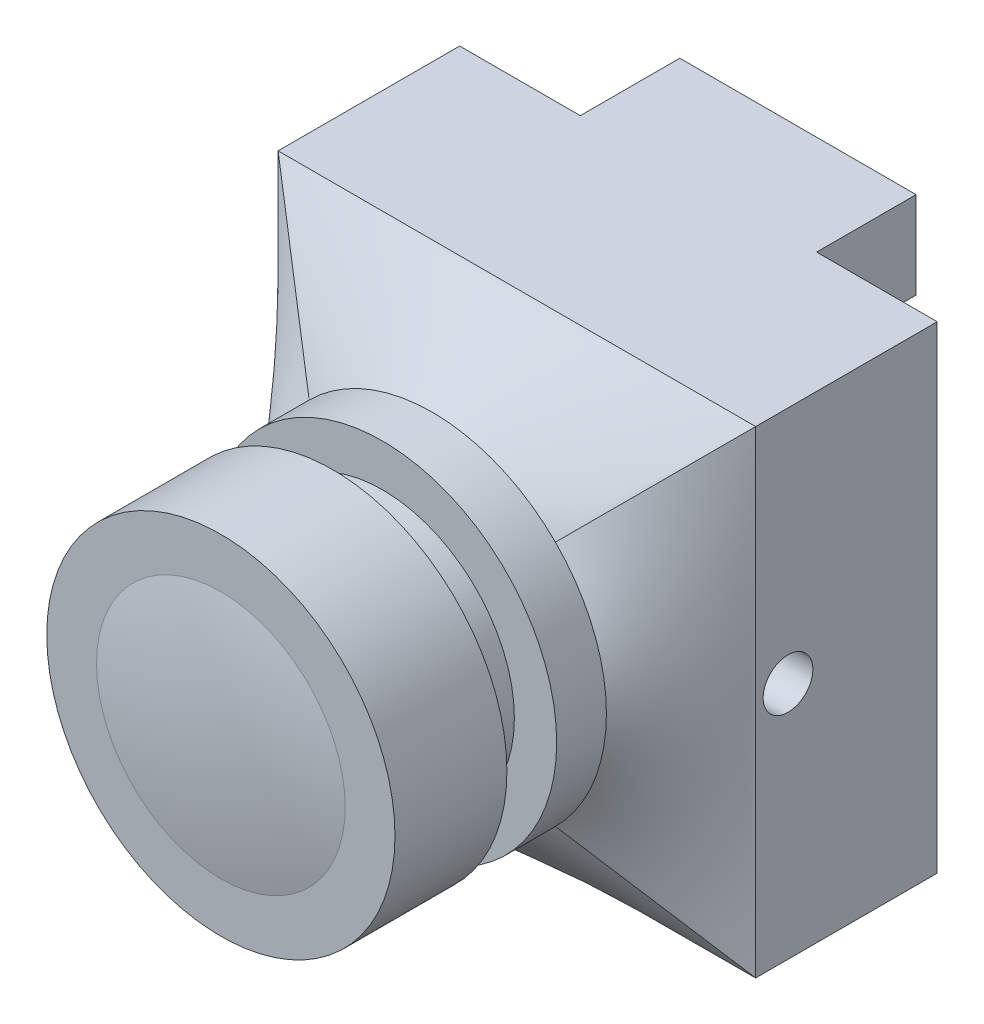
ISO-10303-21;
HEADER;
FILE_DESCRIPTION(('STEP AP214'),'2;1');
FILE_NAME('part.step','',(''),(''),'','','');
FILE_SCHEMA(('AUTOMOTIVE_DESIGN { 1 0 10303 214 1 1 1 1 }'));
ENDSEC;
DATA;
#1=APPLICATION_CONTEXT('core data for automotive mechanical design processes');
#2=APPLICATION_PROTOCOL_DEFINITION('international standard','automotive_design',2000,#1);
#3=PRODUCT_CONTEXT('',#1,'mechanical');
#4=PRODUCT('Part','Part','',(#3));
#5=PRODUCT_RELATED_PRODUCT_CATEGORY('part','',(#4));
#6=PRODUCT_DEFINITION_FORMATION('','',#4);
#7=PRODUCT_DEFINITION_CONTEXT('part definition',#1,'design');
#8=PRODUCT_DEFINITION('design','',#6,#7);
#9=PRODUCT_DEFINITION_SHAPE('','',#8);
#10=(LENGTH_UNIT() NAMED_UNIT(*) SI_UNIT(.MILLI.,.METRE.));
#11=(NAMED_UNIT(*) PLANE_ANGLE_UNIT() SI_UNIT($,.RADIAN.));
#12=(NAMED_UNIT(*) SI_UNIT($,.STERADIAN.) SOLID_ANGLE_UNIT());
#13=UNCERTAINTY_MEASURE_WITH_UNIT(LENGTH_MEASURE(1.E-05),#10,'distance_accuracy_value','');
#14=(GEOMETRIC_REPRESENTATION_CONTEXT(3) GLOBAL_UNCERTAINTY_ASSIGNED_CONTEXT((#13)) GLOBAL_UNIT_ASSIGNED_CONTEXT((#10,
#11,#12)) REPRESENTATION_CONTEXT('',''));
#15=CARTESIAN_POINT('',(0.,0.,0.));
#16=DIRECTION('',(0.,0.,1.));
#17=DIRECTION('',(1.,0.,0.));
#18=AXIS2_PLACEMENT_3D('',#15,#16,#17);
#19=CARTESIAN_POINT('',(0.,0.,0.));
#20=DIRECTION('',(0.,0.,1.));
#21=DIRECTION('',(1.,0.,0.));
#22=AXIS2_PLACEMENT_3D('',#19,#20,#21);
#23=PLANE('',#22);
#24=DIRECTION('',(0.,-1.,0.));
#25=VECTOR('',#24,1.);
#26=CARTESIAN_POINT('',(4.75,9.6,0.));
#27=LINE('',#26,#25);
#28=CARTESIAN_POINT('',(4.75,9.6,0.));
#29=VERTEX_POINT('',#28);
#30=CARTESIAN_POINT('',(4.75,6.1,0.));
#31=VERTEX_POINT('',#30);
#32=EDGE_CURVE('E180',#29,#31,#27,.T.);
#33=ORIENTED_EDGE('',*,*,#32,.F.);
#34=DIRECTION('',(-1.,0.,0.));
#35=VECTOR('',#34,1.);
#36=CARTESIAN_POINT('',(-9.6,9.6,0.));
#37=LINE('',#36,#35);
#38=CARTESIAN_POINT('',(9.6,9.6,0.));
#39=VERTEX_POINT('',#38);
#40=EDGE_CURVE('E384',#39,#29,#37,.T.);
#41=ORIENTED_EDGE('',*,*,#40,.F.);
#42=DIRECTION('',(0.,1.,0.));
#43=VECTOR('',#42,1.);
#44=CARTESIAN_POINT('',(9.6,9.6,0.));
#45=LINE('',#44,#43);
#46=CARTESIAN_POINT('',(9.6,-9.6,0.));
#47=VERTEX_POINT('',#46);
#48=EDGE_CURVE('E336',#47,#39,#45,.T.);
#49=ORIENTED_EDGE('',*,*,#48,.F.);
#50=DIRECTION('',(1.,0.,0.));
#51=VECTOR('',#50,1.);
#52=CARTESIAN_POINT('',(-9.6,-9.6,0.));
#53=LINE('',#52,#51);
#54=CARTESIAN_POINT('',(-9.6,-9.6,0.));
#55=VERTEX_POINT('',#54);
#56=EDGE_CURVE('E355',#55,#47,#53,.T.);
#57=ORIENTED_EDGE('',*,*,#56,.F.);
#58=DIRECTION('',(0.,-1.,0.));
#59=VECTOR('',#58,1.);
#60=CARTESIAN_POINT('',(-9.6,9.6,0.));
#61=LINE('',#60,#59);
#62=CARTESIAN_POINT('',(-9.6,9.6,0.));
#63=VERTEX_POINT('',#62);
#64=EDGE_CURVE('E360',#63,#55,#61,.T.);
#65=ORIENTED_EDGE('',*,*,#64,.F.);
#66=CARTESIAN_POINT('',(-4.75,9.6,0.));
#67=VERTEX_POINT('',#66);
#68=EDGE_CURVE('E98',#67,#63,#37,.T.);
#69=ORIENTED_EDGE('',*,*,#68,.F.);
#70=DIRECTION('',(0.,1.,0.));
#71=VECTOR('',#70,1.);
#72=CARTESIAN_POINT('',(-4.75,9.6,0.));
#73=LINE('',#72,#71);
#74=CARTESIAN_POINT('',(-4.75,6.1,0.));
#75=VERTEX_POINT('',#74);
#76=EDGE_CURVE('E177',#75,#67,#73,.T.);
#77=ORIENTED_EDGE('',*,*,#76,.F.);
#78=DIRECTION('',(-1.,0.,0.));
#79=VECTOR('',#78,1.);
#80=CARTESIAN_POINT('',(4.75,6.1,0.));
#81=LINE('',#80,#79);
#82=EDGE_CURVE('E92',#31,#75,#81,.T.);
#83=ORIENTED_EDGE('',*,*,#82,.F.);
#84=EDGE_LOOP('',(#33,#41,#49,#57,#65,#69,#77,#83));
#85=FACE_BOUND('',#84,.T.);
#86=ADVANCED_FACE('F73',(#85),#23,.F.);
#87=CARTESIAN_POINT('',(9.6,9.6,7.3));
#88=DIRECTION('',(-1.,0.,0.));
#89=DIRECTION('',(0.,0.,1.));
#90=AXIS2_PLACEMENT_3D('',#87,#88,#89);
#91=PLANE('',#90);
#92=CARTESIAN_POINT('',(9.6,0.,6.));
#93=DIRECTION('',(1.,0.,0.));
#94=DIRECTION('',(0.,0.,-1.));
#95=AXIS2_PLACEMENT_3D('',#92,#93,#94);
#96=CIRCLE('',#95,1.);
#97=CARTESIAN_POINT('',(9.6,0.,5.));
#98=VERTEX_POINT('',#97);
#99=EDGE_CURVE('E182',#98,#98,#96,.T.);
#100=ORIENTED_EDGE('',*,*,#99,.F.);
#101=EDGE_LOOP('',(#100));
#102=FACE_BOUND('',#101,.T.);
#103=ORIENTED_EDGE('',*,*,#48,.T.);
#104=DIRECTION('',(0.,0.,-1.));
#105=VECTOR('',#104,1.);
#106=CARTESIAN_POINT('',(9.6,9.6,7.3));
#107=LINE('',#106,#105);
#108=CARTESIAN_POINT('',(9.6,9.6,7.3));
#109=VERTEX_POINT('',#108);
#110=EDGE_CURVE('E84',#109,#39,#107,.T.);
#111=ORIENTED_EDGE('',*,*,#110,.F.);
#112=DIRECTION('',(0.,1.,0.));
#113=VECTOR('',#112,1.);
#114=CARTESIAN_POINT('',(9.6,9.6,7.3));
#115=LINE('',#114,#113);
#116=CARTESIAN_POINT('',(9.6,-9.6,7.3));
#117=VERTEX_POINT('',#116);
#118=EDGE_CURVE('E349',#117,#109,#115,.T.);
#119=ORIENTED_EDGE('',*,*,#118,.F.);
#120=DIRECTION('',(0.,0.,-1.));
#121=VECTOR('',#120,1.);
#122=CARTESIAN_POINT('',(9.6,-9.6,7.3));
#123=LINE('',#122,#121);
#124=EDGE_CURVE('E366',#117,#47,#123,.T.);
#125=ORIENTED_EDGE('',*,*,#124,.T.);
#126=EDGE_LOOP('',(#103,#111,#119,#125));
#127=FACE_BOUND('',#126,.T.);
#128=ADVANCED_FACE('F75',(#102,#127),#91,.F.);
#129=CARTESIAN_POINT('',(-9.6,9.6,7.3));
#130=DIRECTION('',(0.,-1.,0.));
#131=DIRECTION('',(0.,0.,-1.));
#132=AXIS2_PLACEMENT_3D('',#129,#130,#131);
#133=PLANE('',#132);
#134=ORIENTED_EDGE('',*,*,#40,.T.);
#135=DIRECTION('',(0.,0.,1.));
#136=VECTOR('',#135,1.);
#137=CARTESIAN_POINT('',(4.75,9.6,-4.));
#138=LINE('',#137,#136);
#139=CARTESIAN_POINT('',(4.75,9.6,-4.));
#140=VERTEX_POINT('',#139);
#141=EDGE_CURVE('E462',#140,#29,#138,.T.);
#142=ORIENTED_EDGE('',*,*,#141,.F.);
#143=DIRECTION('',(1.,0.,0.));
#144=VECTOR('',#143,1.);
#145=CARTESIAN_POINT('',(4.75,9.6,-4.));
#146=LINE('',#145,#144);
#147=CARTESIAN_POINT('',(-4.75,9.6,-4.));
#148=VERTEX_POINT('',#147);
#149=EDGE_CURVE('E172',#148,#140,#146,.T.);
#150=ORIENTED_EDGE('',*,*,#149,.F.);
#151=DIRECTION('',(0.,0.,1.));
#152=VECTOR('',#151,1.);
#153=CARTESIAN_POINT('',(-4.75,9.6,-4.));
#154=LINE('',#153,#152);
#155=EDGE_CURVE('E189',#148,#67,#154,.T.);
#156=ORIENTED_EDGE('',*,*,#155,.T.);
#157=ORIENTED_EDGE('',*,*,#68,.T.);
#158=DIRECTION('',(0.,0.,-1.));
#159=VECTOR('',#158,1.);
#160=CARTESIAN_POINT('',(-9.6,9.6,7.3));
#161=LINE('',#160,#159);
#162=CARTESIAN_POINT('',(-9.6,9.6,7.3));
#163=VERTEX_POINT('',#162);
#164=EDGE_CURVE('E373',#163,#63,#161,.T.);
#165=ORIENTED_EDGE('',*,*,#164,.F.);
#166=DIRECTION('',(1.,0.,0.));
#167=VECTOR('',#166,1.);
#168=CARTESIAN_POINT('',(-9.6,9.6,7.3));
#169=LINE('',#168,#167);
#170=EDGE_CURVE('E331',#109,#163,#169,.F.);
#171=ORIENTED_EDGE('',*,*,#170,.F.);
#172=ORIENTED_EDGE('',*,*,#110,.T.);
#173=EDGE_LOOP('',(#134,#142,#150,#156,#157,#165,#171,#172));
#174=FACE_BOUND('',#173,.T.);
#175=ADVANCED_FACE('F456',(#174),#133,.F.);
#176=CARTESIAN_POINT('',(-9.6,9.6,7.3));
#177=DIRECTION('',(1.,0.,0.));
#178=DIRECTION('',(0.,0.,-1.));
#179=AXIS2_PLACEMENT_3D('',#176,#177,#178);
#180=PLANE('',#179);
#181=CARTESIAN_POINT('',(-9.6,0.,6.));
#182=DIRECTION('',(1.,0.,0.));
#183=DIRECTION('',(0.,0.,-1.));
#184=AXIS2_PLACEMENT_3D('',#181,#182,#183);
#185=CIRCLE('',#184,1.);
#186=CARTESIAN_POINT('',(-9.6,0.,5.));
#187=VERTEX_POINT('',#186);
#188=EDGE_CURVE('E187',#187,#187,#185,.T.);
#189=ORIENTED_EDGE('',*,*,#188,.T.);
#190=EDGE_LOOP('',(#189));
#191=FACE_BOUND('',#190,.T.);
#192=ORIENTED_EDGE('',*,*,#64,.T.);
#193=DIRECTION('',(0.,0.,-1.));
#194=VECTOR('',#193,1.);
#195=CARTESIAN_POINT('',(-9.6,-9.6,7.3));
#196=LINE('',#195,#194);
#197=CARTESIAN_POINT('',(-9.6,-9.6,7.3));
#198=VERTEX_POINT('',#197);
#199=EDGE_CURVE('E369',#198,#55,#196,.T.);
#200=ORIENTED_EDGE('',*,*,#199,.F.);
#201=DIRECTION('',(0.,1.,0.));
#202=VECTOR('',#201,1.);
#203=CARTESIAN_POINT('',(-9.6,9.6,7.3));
#204=LINE('',#203,#202);
#205=EDGE_CURVE('E359',#163,#198,#204,.F.);
#206=ORIENTED_EDGE('',*,*,#205,.F.);
#207=ORIENTED_EDGE('',*,*,#164,.T.);
#208=EDGE_LOOP('',(#192,#200,#206,#207));
#209=FACE_BOUND('',#208,.T.);
#210=ADVANCED_FACE('F454',(#191,#209),#180,.F.);
#211=CARTESIAN_POINT('',(-9.6,-9.6,7.3));
#212=DIRECTION('',(0.,1.,0.));
#213=DIRECTION('',(0.,0.,1.));
#214=AXIS2_PLACEMENT_3D('',#211,#212,#213);
#215=PLANE('',#214);
#216=ORIENTED_EDGE('',*,*,#56,.T.);
#217=ORIENTED_EDGE('',*,*,#124,.F.);
#218=DIRECTION('',(1.,0.,0.));
#219=VECTOR('',#218,1.);
#220=CARTESIAN_POINT('',(-9.6,-9.6,7.3));
#221=LINE('',#220,#219);
#222=EDGE_CURVE('E363',#198,#117,#221,.T.);
#223=ORIENTED_EDGE('',*,*,#222,.F.);
#224=ORIENTED_EDGE('',*,*,#199,.T.);
#225=EDGE_LOOP('',(#216,#217,#223,#224));
#226=FACE_BOUND('',#225,.T.);
#227=ADVANCED_FACE('F450',(#226),#215,.F.);
#228=CARTESIAN_POINT('',(9.6,-9.6,7.3));
#229=CARTESIAN_POINT('',(4.94974746830583,-4.94974746830583,10.7));
#230=CARTESIAN_POINT('',(9.6,-8.8,7.3));
#231=CARTESIAN_POINT('',(5.2414141349725,-4.65808080163917,10.7));
#232=CARTESIAN_POINT('',(9.6,-8.,7.3));
#233=CARTESIAN_POINT('',(5.51805960745283,-4.32957833687793,10.7));
#234=CARTESIAN_POINT('',(9.6,-6.4,7.3));
#235=CARTESIAN_POINT('',(6.01750922433455,-3.60330586290059,10.7));
#236=CARTESIAN_POINT('',(9.6,-5.6,7.3));
#237=CARTESIAN_POINT('',(6.240151659734,-3.20549876475148,10.7));
#238=CARTESIAN_POINT('',(9.6,-3.99999999999999,7.3));
#239=CARTESIAN_POINT('',(6.6082346322556,-2.35498410023551,10.7));
#240=CARTESIAN_POINT('',(9.6,-3.19999999999999,7.3));
#241=CARTESIAN_POINT('',(6.75349475440457,-1.9023431213879,10.7));
#242=CARTESIAN_POINT('',(9.6,-1.59999999999999,7.3));
#243=CARTESIAN_POINT('',(6.9494382537719,-0.966389520987098,10.7));
#244=CARTESIAN_POINT('',(9.6,-0.799999999999995,7.3));
#245=CARTESIAN_POINT('',(7.,-0.483249156101945,10.7));
#246=CARTESIAN_POINT('',(9.6,0.800000000000005,7.3));
#247=CARTESIAN_POINT('',(7.,0.483249156101943,10.7));
#248=CARTESIAN_POINT('',(9.6,1.6,7.3));
#249=CARTESIAN_POINT('',(6.9494382537719,0.966389520987096,10.7));
#250=CARTESIAN_POINT('',(9.6,3.20000000000001,7.3));
#251=CARTESIAN_POINT('',(6.75349475440457,1.9023431213879,10.7));
#252=CARTESIAN_POINT('',(9.6,4.00000000000001,7.3));
#253=CARTESIAN_POINT('',(6.60823463225559,2.35498410023551,10.7));
#254=CARTESIAN_POINT('',(9.6,5.60000000000001,7.3));
#255=CARTESIAN_POINT('',(6.240151659734,3.20549876475148,10.7));
#256=CARTESIAN_POINT('',(9.6,6.4,7.3));
#257=CARTESIAN_POINT('',(6.01750922433455,3.60330586290059,10.7));
#258=CARTESIAN_POINT('',(9.6,8.,7.3));
#259=CARTESIAN_POINT('',(5.51805960745283,4.32957833687792,10.7));
#260=CARTESIAN_POINT('',(9.6,8.8,7.3));
#261=CARTESIAN_POINT('',(5.2414141349725,4.65808080163917,10.7));
#262=CARTESIAN_POINT('',(9.6,9.6,7.3));
#263=CARTESIAN_POINT('',(4.94974746830583,4.94974746830583,10.7));
#264=B_SPLINE_SURFACE_WITH_KNOTS('',3,1,((#228,#229),(#230,#231),(#232,#233),(#234,#235),(#236,
#237),(#238,#239),(#240,#241),(#242,#243),(#244,#245),(#246,#247),(#248,#249),(#250,#251),(#252,
#253),(#254,#255),(#256,#257),(#258,#259),(#260,#261),(#262,#263)),.UNSPECIFIED.,.F.,.F.,.F.,(4,
2,2,2,2,2,2,2,4),(2,2),(0.,0.125,0.25,0.375,0.5,0.625,0.75,0.875,1.),(0.,1.),.UNSPECIFIED.);
#265=DIRECTION('',(-0.628127541614492,-0.628127541614492,0.4592511109738));
#266=VECTOR('',#265,1.);
#267=CARTESIAN_POINT('',(7.27487373415292,7.27487373415292,9.));
#268=LINE('',#267,#266);
#269=CARTESIAN_POINT('',(4.94974746830583,4.94974746830583,10.7));
#270=VERTEX_POINT('',#269);
#271=EDGE_CURVE('E282',#109,#270,#268,.T.);
#272=CARTESIAN_POINT('',(0.,0.,10.7));
#273=DIRECTION('',(0.,0.,1.));
#274=DIRECTION('',(1.,0.,0.));
#275=AXIS2_PLACEMENT_3D('',#272,#273,#274);
#276=CIRCLE('',#275,7.);
#277=CARTESIAN_POINT('',(4.94974746830583,-4.94974746830583,10.7));
#278=VERTEX_POINT('',#277);
#279=EDGE_CURVE('E77',#278,#270,#276,.T.);
#280=DIRECTION('',(0.628127541614492,-0.628127541614492,-0.4592511109738));
#281=VECTOR('',#280,1.);
#282=CARTESIAN_POINT('',(7.27487373415291,-7.27487373415292,9.));
#283=LINE('',#282,#281);
#284=EDGE_CURVE('E278',#278,#117,#283,.T.);
#285=ORIENTED_EDGE('',*,*,#118,.T.);
#286=ORIENTED_EDGE('',*,*,#271,.T.);
#287=ORIENTED_EDGE('',*,*,#279,.F.);
#288=ORIENTED_EDGE('',*,*,#284,.T.);
#289=EDGE_LOOP('',(#285,#286,#287,#288));
#290=FACE_BOUND('',#289,.T.);
#291=ADVANCED_FACE('F239',(#290),#264,.T.);
#292=CARTESIAN_POINT('',(9.6,9.6,7.3));
#293=CARTESIAN_POINT('',(4.94974746830583,4.94974746830583,10.7));
#294=CARTESIAN_POINT('',(8.8,9.6,7.3));
#295=CARTESIAN_POINT('',(4.65808080163917,5.2414141349725,10.7));
#296=CARTESIAN_POINT('',(8.,9.6,7.3));
#297=CARTESIAN_POINT('',(4.32957833687792,5.51805960745283,10.7));
#298=CARTESIAN_POINT('',(6.4,9.6,7.3));
#299=CARTESIAN_POINT('',(3.60330586290059,6.01750922433454,10.7));
#300=CARTESIAN_POINT('',(5.6,9.6,7.3));
#301=CARTESIAN_POINT('',(3.20549876475148,6.240151659734,10.7));
#302=CARTESIAN_POINT('',(4.,9.6,7.3));
#303=CARTESIAN_POINT('',(2.35498410023551,6.6082346322556,10.7));
#304=CARTESIAN_POINT('',(3.2,9.6,7.3));
#305=CARTESIAN_POINT('',(1.9023431213879,6.75349475440457,10.7));
#306=CARTESIAN_POINT('',(1.6,9.6,7.3));
#307=CARTESIAN_POINT('',(0.966389520987097,6.9494382537719,10.7));
#308=CARTESIAN_POINT('',(0.799999999999996,9.6,7.3));
#309=CARTESIAN_POINT('',(0.483249156101945,7.,10.7));
#310=CARTESIAN_POINT('',(-0.800000000000004,9.6,7.3));
#311=CARTESIAN_POINT('',(-0.483249156101944,7.,10.7));
#312=CARTESIAN_POINT('',(-1.6,9.6,7.3));
#313=CARTESIAN_POINT('',(-0.966389520987097,6.9494382537719,10.7));
#314=CARTESIAN_POINT('',(-3.2,9.6,7.3));
#315=CARTESIAN_POINT('',(-1.9023431213879,6.75349475440457,10.7));
#316=CARTESIAN_POINT('',(-4.,9.6,7.3));
#317=CARTESIAN_POINT('',(-2.35498410023551,6.60823463225559,10.7));
#318=CARTESIAN_POINT('',(-5.6,9.6,7.3));
#319=CARTESIAN_POINT('',(-3.20549876475148,6.240151659734,10.7));
#320=CARTESIAN_POINT('',(-6.4,9.6,7.3));
#321=CARTESIAN_POINT('',(-3.60330586290059,6.01750922433455,10.7));
#322=CARTESIAN_POINT('',(-8.,9.6,7.3));
#323=CARTESIAN_POINT('',(-4.32957833687792,5.51805960745283,10.7));
#324=CARTESIAN_POINT('',(-8.8,9.6,7.3));
#325=CARTESIAN_POINT('',(-4.65808080163917,5.2414141349725,10.7));
#326=CARTESIAN_POINT('',(-9.6,9.6,7.3));
#327=CARTESIAN_POINT('',(-4.94974746830583,4.94974746830583,10.7));
#328=B_SPLINE_SURFACE_WITH_KNOTS('',3,1,((#292,#293),(#294,#295),(#296,#297),(#298,#299),(#300,
#301),(#302,#303),(#304,#305),(#306,#307),(#308,#309),(#310,#311),(#312,#313),(#314,#315),(#316,
#317),(#318,#319),(#320,#321),(#322,#323),(#324,#325),(#326,#327)),.UNSPECIFIED.,.F.,.F.,.F.,(4,
2,2,2,2,2,2,2,4),(2,2),(0.,0.125,0.25,0.375,0.5,0.625,0.75,0.875,1.),(0.,1.),.UNSPECIFIED.);
#329=DIRECTION('',(0.628127541614492,-0.628127541614492,0.4592511109738));
#330=VECTOR('',#329,1.);
#331=CARTESIAN_POINT('',(-7.27487373415292,7.27487373415292,9.));
#332=LINE('',#331,#330);
#333=CARTESIAN_POINT('',(-4.94974746830583,4.94974746830583,10.7));
#334=VERTEX_POINT('',#333);
#335=EDGE_CURVE('E321',#163,#334,#332,.T.);
#336=EDGE_CURVE('E276',#270,#334,#276,.T.);
#337=ORIENTED_EDGE('',*,*,#170,.T.);
#338=ORIENTED_EDGE('',*,*,#335,.T.);
#339=ORIENTED_EDGE('',*,*,#336,.F.);
#340=ORIENTED_EDGE('',*,*,#271,.F.);
#341=EDGE_LOOP('',(#337,#338,#339,#340));
#342=FACE_BOUND('',#341,.T.);
#343=ADVANCED_FACE('F327',(#342),#328,.T.);
#344=CARTESIAN_POINT('',(-9.6,-9.6,7.3));
#345=CARTESIAN_POINT('',(-4.94974746830583,-4.94974746830583,10.7));
#346=CARTESIAN_POINT('',(-8.8,-9.6,7.3));
#347=CARTESIAN_POINT('',(-4.65808080163917,-5.2414141349725,10.7));
#348=CARTESIAN_POINT('',(-8.,-9.6,7.3));
#349=CARTESIAN_POINT('',(-4.32957833687793,-5.51805960745283,10.7));
#350=CARTESIAN_POINT('',(-6.4,-9.6,7.3));
#351=CARTESIAN_POINT('',(-3.60330586290059,-6.01750922433455,10.7));
#352=CARTESIAN_POINT('',(-5.6,-9.6,7.3));
#353=CARTESIAN_POINT('',(-3.20549876475148,-6.240151659734,10.7));
#354=CARTESIAN_POINT('',(-3.99999999999999,-9.6,7.3));
#355=CARTESIAN_POINT('',(-2.35498410023551,-6.6082346322556,10.7));
#356=CARTESIAN_POINT('',(-3.19999999999999,-9.6,7.3));
#357=CARTESIAN_POINT('',(-1.9023431213879,-6.75349475440457,10.7));
#358=CARTESIAN_POINT('',(-1.59999999999999,-9.6,7.3));
#359=CARTESIAN_POINT('',(-0.966389520987099,-6.9494382537719,10.7));
#360=CARTESIAN_POINT('',(-0.799999999999995,-9.6,7.3));
#361=CARTESIAN_POINT('',(-0.483249156101946,-7.,10.7));
#362=CARTESIAN_POINT('',(0.800000000000005,-9.6,7.3));
#363=CARTESIAN_POINT('',(0.483249156101943,-7.,10.7));
#364=CARTESIAN_POINT('',(1.6,-9.6,7.3));
#365=CARTESIAN_POINT('',(0.966389520987096,-6.9494382537719,10.7));
#366=CARTESIAN_POINT('',(3.20000000000001,-9.6,7.3));
#367=CARTESIAN_POINT('',(1.9023431213879,-6.75349475440457,10.7));
#368=CARTESIAN_POINT('',(4.00000000000001,-9.6,7.3));
#369=CARTESIAN_POINT('',(2.35498410023551,-6.60823463225559,10.7));
#370=CARTESIAN_POINT('',(5.60000000000001,-9.6,7.3));
#371=CARTESIAN_POINT('',(3.20549876475148,-6.240151659734,10.7));
#372=CARTESIAN_POINT('',(6.4,-9.6,7.3));
#373=CARTESIAN_POINT('',(3.60330586290059,-6.01750922433455,10.7));
#374=CARTESIAN_POINT('',(8.,-9.6,7.3));
#375=CARTESIAN_POINT('',(4.32957833687792,-5.51805960745283,10.7));
#376=CARTESIAN_POINT('',(8.8,-9.6,7.3));
#377=CARTESIAN_POINT('',(4.65808080163916,-5.2414141349725,10.7));
#378=CARTESIAN_POINT('',(9.6,-9.6,7.3));
#379=CARTESIAN_POINT('',(4.94974746830583,-4.94974746830583,10.7));
#380=B_SPLINE_SURFACE_WITH_KNOTS('',3,1,((#344,#345),(#346,#347),(#348,#349),(#350,#351),(#352,
#353),(#354,#355),(#356,#357),(#358,#359),(#360,#361),(#362,#363),(#364,#365),(#366,#367),(#368,
#369),(#370,#371),(#372,#373),(#374,#375),(#376,#377),(#378,#379)),.UNSPECIFIED.,.F.,.F.,.F.,(4,
2,2,2,2,2,2,2,4),(2,2),(0.,0.125,0.25,0.375,0.5,0.625,0.75,0.875,1.),(0.,1.),.UNSPECIFIED.);
#381=CARTESIAN_POINT('',(-4.94974746830583,-4.94974746830583,10.7));
#382=VERTEX_POINT('',#381);
#383=EDGE_CURVE('E264',#382,#278,#276,.T.);
#384=DIRECTION('',(0.628127541614492,0.628127541614492,0.4592511109738));
#385=VECTOR('',#384,1.);
#386=CARTESIAN_POINT('',(-7.27487373415292,-7.27487373415292,9.));
#387=LINE('',#386,#385);
#388=EDGE_CURVE('E267',#198,#382,#387,.T.);
#389=ORIENTED_EDGE('',*,*,#222,.T.);
#390=ORIENTED_EDGE('',*,*,#284,.F.);
#391=ORIENTED_EDGE('',*,*,#383,.F.);
#392=ORIENTED_EDGE('',*,*,#388,.F.);
#393=EDGE_LOOP('',(#389,#390,#391,#392));
#394=FACE_BOUND('',#393,.T.);
#395=ADVANCED_FACE('F404',(#394),#380,.T.);
#396=CARTESIAN_POINT('',(-9.6,9.6,7.3));
#397=CARTESIAN_POINT('',(-4.94974746830583,4.94974746830583,10.7));
#398=CARTESIAN_POINT('',(-9.6,8.8,7.3));
#399=CARTESIAN_POINT('',(-5.2414141349725,4.65808080163917,10.7));
#400=CARTESIAN_POINT('',(-9.6,8.,7.3));
#401=CARTESIAN_POINT('',(-5.51805960745283,4.32957833687792,10.7));
#402=CARTESIAN_POINT('',(-9.6,6.4,7.3));
#403=CARTESIAN_POINT('',(-6.01750922433454,3.60330586290059,10.7));
#404=CARTESIAN_POINT('',(-9.6,5.6,7.3));
#405=CARTESIAN_POINT('',(-6.240151659734,3.20549876475148,10.7));
#406=CARTESIAN_POINT('',(-9.6,4.,7.3));
#407=CARTESIAN_POINT('',(-6.6082346322556,2.35498410023551,10.7));
#408=CARTESIAN_POINT('',(-9.6,3.2,7.3));
#409=CARTESIAN_POINT('',(-6.75349475440457,1.9023431213879,10.7));
#410=CARTESIAN_POINT('',(-9.6,1.6,7.3));
#411=CARTESIAN_POINT('',(-6.9494382537719,0.966389520987098,10.7));
#412=CARTESIAN_POINT('',(-9.6,0.799999999999996,7.3));
#413=CARTESIAN_POINT('',(-7.,0.483249156101945,10.7));
#414=CARTESIAN_POINT('',(-9.6,-0.800000000000004,7.3));
#415=CARTESIAN_POINT('',(-7.,-0.483249156101943,10.7));
#416=CARTESIAN_POINT('',(-9.6,-1.6,7.3));
#417=CARTESIAN_POINT('',(-6.9494382537719,-0.966389520987096,10.7));
#418=CARTESIAN_POINT('',(-9.6,-3.2,7.3));
#419=CARTESIAN_POINT('',(-6.75349475440457,-1.9023431213879,10.7));
#420=CARTESIAN_POINT('',(-9.6,-4.,7.3));
#421=CARTESIAN_POINT('',(-6.6082346322556,-2.35498410023551,10.7));
#422=CARTESIAN_POINT('',(-9.6,-5.6,7.3));
#423=CARTESIAN_POINT('',(-6.240151659734,-3.20549876475148,10.7));
#424=CARTESIAN_POINT('',(-9.6,-6.4,7.3));
#425=CARTESIAN_POINT('',(-6.01750922433455,-3.60330586290059,10.7));
#426=CARTESIAN_POINT('',(-9.6,-8.,7.3));
#427=CARTESIAN_POINT('',(-5.51805960745283,-4.32957833687793,10.7));
#428=CARTESIAN_POINT('',(-9.6,-8.8,7.3));
#429=CARTESIAN_POINT('',(-5.2414141349725,-4.65808080163917,10.7));
#430=CARTESIAN_POINT('',(-9.6,-9.6,7.3));
#431=CARTESIAN_POINT('',(-4.94974746830583,-4.94974746830583,10.7));
#432=B_SPLINE_SURFACE_WITH_KNOTS('',3,1,((#396,#397),(#398,#399),(#400,#401),(#402,#403),(#404,
#405),(#406,#407),(#408,#409),(#410,#411),(#412,#413),(#414,#415),(#416,#417),(#418,#419),(#420,
#421),(#422,#423),(#424,#425),(#426,#427),(#428,#429),(#430,#431)),.UNSPECIFIED.,.F.,.F.,.F.,(4,
2,2,2,2,2,2,2,4),(2,2),(0.,0.125,0.25,0.375,0.5,0.625,0.75,0.875,1.),(0.,1.),.UNSPECIFIED.);
#433=EDGE_CURVE('E272',#334,#382,#276,.T.);
#434=ORIENTED_EDGE('',*,*,#205,.T.);
#435=ORIENTED_EDGE('',*,*,#388,.T.);
#436=ORIENTED_EDGE('',*,*,#433,.F.);
#437=ORIENTED_EDGE('',*,*,#335,.F.);
#438=EDGE_LOOP('',(#434,#435,#436,#437));
#439=FACE_BOUND('',#438,.T.);
#440=ADVANCED_FACE('F237',(#439),#432,.T.);
#441=CARTESIAN_POINT('',(0.,0.,12.7));
#442=DIRECTION('',(0.,0.,-1.));
#443=DIRECTION('',(-1.,0.,0.));
#444=AXIS2_PLACEMENT_3D('',#441,#442,#443);
#445=CYLINDRICAL_SURFACE('',#444,7.);
#446=ORIENTED_EDGE('',*,*,#336,.T.);
#447=ORIENTED_EDGE('',*,*,#433,.T.);
#448=ORIENTED_EDGE('',*,*,#383,.T.);
#449=ORIENTED_EDGE('',*,*,#279,.T.);
#450=EDGE_LOOP('',(#446,#447,#448,#449));
#451=FACE_BOUND('',#450,.T.);
#452=CARTESIAN_POINT('',(0.,0.,12.7));
#453=DIRECTION('',(0.,0.,1.));
#454=DIRECTION('',(1.,0.,0.));
#455=AXIS2_PLACEMENT_3D('',#452,#453,#454);
#456=CIRCLE('',#455,7.);
#457=CARTESIAN_POINT('',(7.,0.,12.7));
#458=VERTEX_POINT('',#457);
#459=EDGE_CURVE('E286',#458,#458,#456,.T.);
#460=ORIENTED_EDGE('',*,*,#459,.F.);
#461=EDGE_LOOP('',(#460));
#462=FACE_BOUND('',#461,.T.);
#463=ADVANCED_FACE('F232',(#451,#462),#445,.T.);
#464=CARTESIAN_POINT('',(0.,0.,12.7));
#465=DIRECTION('',(0.,0.,1.));
#466=DIRECTION('',(1.,0.,0.));
#467=AXIS2_PLACEMENT_3D('',#464,#465,#466);
#468=PLANE('',#467);
#469=CARTESIAN_POINT('',(0.,0.,12.7));
#470=DIRECTION('',(0.,0.,1.));
#471=DIRECTION('',(1.,0.,0.));
#472=AXIS2_PLACEMENT_3D('',#469,#470,#471);
#473=CIRCLE('',#472,5.3);
#474=CARTESIAN_POINT('',(5.3,0.,12.7));
#475=VERTEX_POINT('',#474);
#476=EDGE_CURVE('E12',#475,#475,#473,.T.);
#477=ORIENTED_EDGE('',*,*,#476,.F.);
#478=EDGE_LOOP('',(#477));
#479=FACE_BOUND('',#478,.T.);
#480=ORIENTED_EDGE('',*,*,#459,.T.);
#481=EDGE_LOOP('',(#480));
#482=FACE_BOUND('',#481,.T.);
#483=ADVANCED_FACE('F228',(#479,#482),#468,.T.);
#484=CARTESIAN_POINT('',(0.,0.,14.7));
#485=DIRECTION('',(0.,0.,-1.));
#486=DIRECTION('',(-1.,0.,0.));
#487=AXIS2_PLACEMENT_3D('',#484,#485,#486);
#488=CYLINDRICAL_SURFACE('',#487,5.3);
#489=CARTESIAN_POINT('',(0.,0.,14.7));
#490=DIRECTION('',(0.,0.,1.));
#491=DIRECTION('',(1.,0.,0.));
#492=AXIS2_PLACEMENT_3D('',#489,#490,#491);
#493=CIRCLE('',#492,5.3);
#494=CARTESIAN_POINT('',(5.3,0.,14.7));
#495=VERTEX_POINT('',#494);
#496=EDGE_CURVE('E289',#495,#495,#493,.T.);
#497=ORIENTED_EDGE('',*,*,#496,.F.);
#498=EDGE_LOOP('',(#497));
#499=FACE_BOUND('',#498,.T.);
#500=ORIENTED_EDGE('',*,*,#476,.T.);
#501=EDGE_LOOP('',(#500));
#502=FACE_BOUND('',#501,.T.);
#503=ADVANCED_FACE('F224',(#499,#502),#488,.T.);
#504=CARTESIAN_POINT('',(0.,0.,19.2));
#505=DIRECTION('',(0.,0.,-1.));
#506=DIRECTION('',(-1.,0.,0.));
#507=AXIS2_PLACEMENT_3D('',#504,#505,#506);
#508=CYLINDRICAL_SURFACE('',#507,7.);
#509=CARTESIAN_POINT('',(0.,0.,19.2));
#510=DIRECTION('',(0.,0.,1.));
#511=DIRECTION('',(1.,0.,0.));
#512=AXIS2_PLACEMENT_3D('',#509,#510,#511);
#513=CIRCLE('',#512,7.);
#514=CARTESIAN_POINT('',(7.,0.,19.2));
#515=VERTEX_POINT('',#514);
#516=EDGE_CURVE('E294',#515,#515,#513,.T.);
#517=ORIENTED_EDGE('',*,*,#516,.F.);
#518=EDGE_LOOP('',(#517));
#519=FACE_BOUND('',#518,.T.);
#520=CARTESIAN_POINT('',(0.,0.,14.7));
#521=DIRECTION('',(0.,0.,1.));
#522=DIRECTION('',(1.,0.,0.));
#523=AXIS2_PLACEMENT_3D('',#520,#521,#522);
#524=CIRCLE('',#523,7.);
#525=CARTESIAN_POINT('',(7.,0.,14.7));
#526=VERTEX_POINT('',#525);
#527=EDGE_CURVE('E297',#526,#526,#524,.T.);
#528=ORIENTED_EDGE('',*,*,#527,.T.);
#529=EDGE_LOOP('',(#528));
#530=FACE_BOUND('',#529,.T.);
#531=ADVANCED_FACE('F217',(#519,#530),#508,.T.);
#532=CARTESIAN_POINT('',(0.,0.,19.2));
#533=DIRECTION('',(0.,0.,1.));
#534=DIRECTION('',(1.,0.,0.));
#535=AXIS2_PLACEMENT_3D('',#532,#533,#534);
#536=PLANE('',#535);
#537=CARTESIAN_POINT('',(0.,0.,19.2));
#538=DIRECTION('',(0.,0.,-1.));
#539=DIRECTION('',(-1.,0.,0.));
#540=AXIS2_PLACEMENT_3D('',#537,#538,#539);
#541=CIRCLE('',#540,5.);
#542=CARTESIAN_POINT('',(-5.,0.,19.2));
#543=VERTEX_POINT('',#542);
#544=EDGE_CURVE('E195',#543,#543,#541,.T.);
#545=ORIENTED_EDGE('',*,*,#544,.T.);
#546=EDGE_LOOP('',(#545));
#547=FACE_BOUND('',#546,.T.);
#548=ORIENTED_EDGE('',*,*,#516,.T.);
#549=EDGE_LOOP('',(#548));
#550=FACE_BOUND('',#549,.T.);
#551=ADVANCED_FACE('F214',(#547,#550),#536,.T.);
#552=CARTESIAN_POINT('',(0.,0.,14.7));
#553=DIRECTION('',(0.,0.,1.));
#554=DIRECTION('',(1.,0.,0.));
#555=AXIS2_PLACEMENT_3D('',#552,#553,#554);
#556=PLANE('',#555);
#557=ORIENTED_EDGE('',*,*,#496,.T.);
#558=EDGE_LOOP('',(#557));
#559=FACE_BOUND('',#558,.T.);
#560=ORIENTED_EDGE('',*,*,#527,.F.);
#561=EDGE_LOOP('',(#560));
#562=FACE_BOUND('',#561,.T.);
#563=ADVANCED_FACE('F211',(#559,#562),#556,.F.);
#564=CARTESIAN_POINT('',(0.,0.,19.7));
#565=CARTESIAN_POINT('',(2.5,0.,19.7));
#566=CARTESIAN_POINT('',(5.,0.,19.2));
#567=B_SPLINE_CURVE_WITH_KNOTS('',2,(#564,#565,#566),.UNSPECIFIED.,.F.,.F.,(3,3),(0.5,1.),.UNSPECIFIED.);
#568=CARTESIAN_POINT('',(0.,0.,19.7));
#569=DIRECTION('',(0.,0.,-1.));
#570=AXIS1_PLACEMENT('',#568,#569);
#571=SURFACE_OF_REVOLUTION('',#567,#570);
#572=ORIENTED_EDGE('',*,*,#544,.F.);
#573=EDGE_LOOP('',(#572));
#574=FACE_BOUND('',#573,.T.);
#575=CARTESIAN_POINT('',(0.,0.,19.7));
#576=VERTEX_POINT('',#575);
#577=VERTEX_LOOP('',#576);
#578=FACE_BOUND('',#577,.T.);
#579=ADVANCED_FACE('F206',(#574,#578),#571,.T.);
#580=CARTESIAN_POINT('',(-9.6,0.,6.));
#581=DIRECTION('',(1.,0.,0.));
#582=DIRECTION('',(0.,0.,-1.));
#583=AXIS2_PLACEMENT_3D('',#580,#581,#582);
#584=CYLINDRICAL_SURFACE('',#583,1.);
#585=ORIENTED_EDGE('',*,*,#188,.F.);
#586=EDGE_LOOP('',(#585));
#587=FACE_BOUND('',#586,.T.);
#588=ORIENTED_EDGE('',*,*,#99,.T.);
#589=EDGE_LOOP('',(#588));
#590=FACE_BOUND('',#589,.T.);
#591=ADVANCED_FACE('F210',(#587,#590),#584,.F.);
#592=CARTESIAN_POINT('',(4.75,9.6,-4.));
#593=DIRECTION('',(-1.,0.,0.));
#594=DIRECTION('',(0.,-1.,0.));
#595=AXIS2_PLACEMENT_3D('',#592,#593,#594);
#596=PLANE('',#595);
#597=ORIENTED_EDGE('',*,*,#32,.T.);
#598=DIRECTION('',(0.,0.,1.));
#599=VECTOR('',#598,1.);
#600=CARTESIAN_POINT('',(4.75,6.1,-4.));
#601=LINE('',#600,#599);
#602=CARTESIAN_POINT('',(4.75,6.1,-4.));
#603=VERTEX_POINT('',#602);
#604=EDGE_CURVE('E159',#603,#31,#601,.T.);
#605=ORIENTED_EDGE('',*,*,#604,.F.);
#606=DIRECTION('',(0.,-1.,0.));
#607=VECTOR('',#606,1.);
#608=CARTESIAN_POINT('',(4.75,9.6,-4.));
#609=LINE('',#608,#607);
#610=EDGE_CURVE('E167',#140,#603,#609,.T.);
#611=ORIENTED_EDGE('',*,*,#610,.F.);
#612=ORIENTED_EDGE('',*,*,#141,.T.);
#613=EDGE_LOOP('',(#597,#605,#611,#612));
#614=FACE_BOUND('',#613,.T.);
#615=ADVANCED_FACE('F179',(#614),#596,.F.);
#616=CARTESIAN_POINT('',(4.75,6.1,-4.));
#617=DIRECTION('',(0.,1.,0.));
#618=DIRECTION('',(-1.,0.,0.));
#619=AXIS2_PLACEMENT_3D('',#616,#617,#618);
#620=PLANE('',#619);
#621=ORIENTED_EDGE('',*,*,#82,.T.);
#622=DIRECTION('',(0.,0.,1.));
#623=VECTOR('',#622,1.);
#624=CARTESIAN_POINT('',(-4.75,6.1,-4.));
#625=LINE('',#624,#623);
#626=CARTESIAN_POINT('',(-4.75,6.1,-4.));
#627=VERTEX_POINT('',#626);
#628=EDGE_CURVE('E162',#627,#75,#625,.T.);
#629=ORIENTED_EDGE('',*,*,#628,.F.);
#630=DIRECTION('',(-1.,0.,0.));
#631=VECTOR('',#630,1.);
#632=CARTESIAN_POINT('',(4.75,6.1,-4.));
#633=LINE('',#632,#631);
#634=EDGE_CURVE('E155',#603,#627,#633,.T.);
#635=ORIENTED_EDGE('',*,*,#634,.F.);
#636=ORIENTED_EDGE('',*,*,#604,.T.);
#637=EDGE_LOOP('',(#621,#629,#635,#636));
#638=FACE_BOUND('',#637,.T.);
#639=ADVANCED_FACE('F157',(#638),#620,.F.);
#640=CARTESIAN_POINT('',(-4.75,9.6,-4.));
#641=DIRECTION('',(1.,0.,0.));
#642=DIRECTION('',(0.,0.,-1.));
#643=AXIS2_PLACEMENT_3D('',#640,#641,#642);
#644=PLANE('',#643);
#645=ORIENTED_EDGE('',*,*,#76,.T.);
#646=ORIENTED_EDGE('',*,*,#155,.F.);
#647=DIRECTION('',(0.,1.,0.));
#648=VECTOR('',#647,1.);
#649=CARTESIAN_POINT('',(-4.75,9.6,-4.));
#650=LINE('',#649,#648);
#651=EDGE_CURVE('E166',#627,#148,#650,.T.);
#652=ORIENTED_EDGE('',*,*,#651,.F.);
#653=ORIENTED_EDGE('',*,*,#628,.T.);
#654=EDGE_LOOP('',(#645,#646,#652,#653));
#655=FACE_BOUND('',#654,.T.);
#656=ADVANCED_FACE('F475',(#655),#644,.F.);
#657=CARTESIAN_POINT('',(0.,0.,-4.));
#658=DIRECTION('',(0.,0.,-1.));
#659=DIRECTION('',(-1.,0.,0.));
#660=AXIS2_PLACEMENT_3D('',#657,#658,#659);
#661=PLANE('',#660);
#662=ORIENTED_EDGE('',*,*,#610,.T.);
#663=ORIENTED_EDGE('',*,*,#634,.T.);
#664=ORIENTED_EDGE('',*,*,#651,.T.);
#665=ORIENTED_EDGE('',*,*,#149,.T.);
#666=EDGE_LOOP('',(#662,#663,#664,#665));
#667=FACE_BOUND('',#666,.T.);
#668=ADVANCED_FACE('F170',(#667),#661,.T.);
#669=CLOSED_SHELL('',(#86,#128,#175,#210,#227,#291,#343,#395,#440,#463,#483,#503,#531,#551,#563,
#579,#591,#615,#639,#656,#668));
#670=MANIFOLD_SOLID_BREP('B2',#669);
#671=ADVANCED_BREP_SHAPE_REPRESENTATION('',(#18,#670),#14);
#672=SHAPE_DEFINITION_REPRESENTATION(#9,#671);
ENDSEC;
END-ISO-10303-21;
